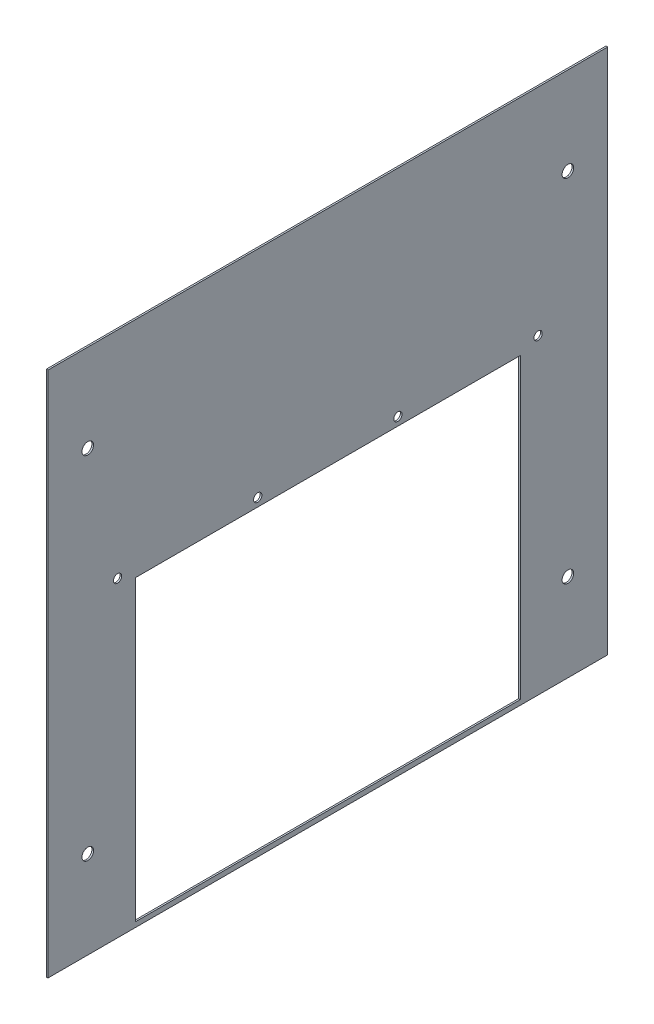
ISO-10303-21;
HEADER;
FILE_DESCRIPTION(('STEP AP214'),'2;1');
FILE_NAME('part.step','',(''),(''),'','','');
FILE_SCHEMA(('AUTOMOTIVE_DESIGN { 1 0 10303 214 1 1 1 1 }'));
ENDSEC;
DATA;
#1=APPLICATION_CONTEXT('core data for automotive mechanical design processes');
#2=APPLICATION_PROTOCOL_DEFINITION('international standard','automotive_design',2000,#1);
#3=PRODUCT_CONTEXT('',#1,'mechanical');
#4=PRODUCT('Part','Part','',(#3));
#5=PRODUCT_RELATED_PRODUCT_CATEGORY('part','',(#4));
#6=PRODUCT_DEFINITION_FORMATION('','',#4);
#7=PRODUCT_DEFINITION_CONTEXT('part definition',#1,'design');
#8=PRODUCT_DEFINITION('design','',#6,#7);
#9=PRODUCT_DEFINITION_SHAPE('','',#8);
#10=(LENGTH_UNIT() NAMED_UNIT(*) SI_UNIT(.MILLI.,.METRE.));
#11=(NAMED_UNIT(*) PLANE_ANGLE_UNIT() SI_UNIT($,.RADIAN.));
#12=(NAMED_UNIT(*) SI_UNIT($,.STERADIAN.) SOLID_ANGLE_UNIT());
#13=UNCERTAINTY_MEASURE_WITH_UNIT(LENGTH_MEASURE(1.E-05),#10,'distance_accuracy_value','');
#14=(GEOMETRIC_REPRESENTATION_CONTEXT(3) GLOBAL_UNCERTAINTY_ASSIGNED_CONTEXT((#13)) GLOBAL_UNIT_ASSIGNED_CONTEXT((#10,
#11,#12)) REPRESENTATION_CONTEXT('',''));
#15=CARTESIAN_POINT('',(0.,0.,0.));
#16=DIRECTION('',(0.,0.,1.));
#17=DIRECTION('',(1.,0.,0.));
#18=AXIS2_PLACEMENT_3D('',#15,#16,#17);
#19=CARTESIAN_POINT('',(1.,0.,0.));
#20=DIRECTION('',(-1.,0.,0.));
#21=DIRECTION('',(0.,0.,1.));
#22=AXIS2_PLACEMENT_3D('',#19,#20,#21);
#23=PLANE('',#22);
#24=CARTESIAN_POINT('',(1.,188.,-296.));
#25=DIRECTION('',(-1.,0.,0.));
#26=DIRECTION('',(0.,0.,1.));
#27=AXIS2_PLACEMENT_3D('',#24,#25,#26);
#28=CIRCLE('',#27,2.50000000000002);
#29=CARTESIAN_POINT('',(1.,188.,-293.5));
#30=VERTEX_POINT('',#29);
#31=EDGE_CURVE('E183',#30,#30,#28,.T.);
#32=ORIENTED_EDGE('',*,*,#31,.T.);
#33=EDGE_LOOP('',(#32));
#34=FACE_BOUND('',#33,.T.);
#35=DIRECTION('',(0.,0.,-1.));
#36=VECTOR('',#35,1.);
#37=CARTESIAN_POINT('',(1.,183.,-285.25));
#38=LINE('',#37,#36);
#39=CARTESIAN_POINT('',(1.,183.,-52.75));
#40=VERTEX_POINT('',#39);
#41=CARTESIAN_POINT('',(1.,183.,-285.25));
#42=VERTEX_POINT('',#41);
#43=EDGE_CURVE('E145',#40,#42,#38,.T.);
#44=ORIENTED_EDGE('',*,*,#43,.T.);
#45=DIRECTION('',(0.,-1.,0.));
#46=VECTOR('',#45,1.);
#47=CARTESIAN_POINT('',(1.,183.,-285.25));
#48=LINE('',#47,#46);
#49=CARTESIAN_POINT('',(1.,3.,-285.25));
#50=VERTEX_POINT('',#49);
#51=EDGE_CURVE('E113',#42,#50,#48,.T.);
#52=ORIENTED_EDGE('',*,*,#51,.T.);
#53=DIRECTION('',(0.,0.,1.));
#54=VECTOR('',#53,1.);
#55=CARTESIAN_POINT('',(1.,3.,-285.25));
#56=LINE('',#55,#54);
#57=CARTESIAN_POINT('',(1.,3.,-52.75));
#58=VERTEX_POINT('',#57);
#59=EDGE_CURVE('E151',#50,#58,#56,.T.);
#60=ORIENTED_EDGE('',*,*,#59,.T.);
#61=DIRECTION('',(0.,1.,0.));
#62=VECTOR('',#61,1.);
#63=CARTESIAN_POINT('',(1.,183.,-52.75));
#64=LINE('',#63,#62);
#65=EDGE_CURVE('E61',#58,#40,#64,.T.);
#66=ORIENTED_EDGE('',*,*,#65,.T.);
#67=EDGE_LOOP('',(#44,#52,#60,#66));
#68=FACE_BOUND('',#67,.T.);
#69=CARTESIAN_POINT('',(1.,188.,-42.));
#70=DIRECTION('',(-1.,0.,0.));
#71=DIRECTION('',(0.,0.,1.));
#72=AXIS2_PLACEMENT_3D('',#69,#70,#71);
#73=CIRCLE('',#72,2.5);
#74=CARTESIAN_POINT('',(1.,188.,-39.5));
#75=VERTEX_POINT('',#74);
#76=EDGE_CURVE('E135',#75,#75,#73,.T.);
#77=ORIENTED_EDGE('',*,*,#76,.T.);
#78=EDGE_LOOP('',(#77));
#79=FACE_BOUND('',#78,.T.);
#80=CARTESIAN_POINT('',(1.,188.,-126.666666666667));
#81=DIRECTION('',(-1.,0.,0.));
#82=DIRECTION('',(0.,0.,1.));
#83=AXIS2_PLACEMENT_3D('',#80,#81,#82);
#84=CIRCLE('',#83,2.5);
#85=CARTESIAN_POINT('',(1.,188.,-124.166666666667));
#86=VERTEX_POINT('',#85);
#87=EDGE_CURVE('E170',#86,#86,#84,.T.);
#88=ORIENTED_EDGE('',*,*,#87,.T.);
#89=EDGE_LOOP('',(#88));
#90=FACE_BOUND('',#89,.T.);
#91=CARTESIAN_POINT('',(1.,188.,-211.333333333333));
#92=DIRECTION('',(-1.,0.,0.));
#93=DIRECTION('',(0.,0.,1.));
#94=AXIS2_PLACEMENT_3D('',#91,#92,#93);
#95=CIRCLE('',#94,2.5);
#96=CARTESIAN_POINT('',(1.,188.,-208.833333333333));
#97=VERTEX_POINT('',#96);
#98=EDGE_CURVE('E162',#97,#97,#95,.T.);
#99=ORIENTED_EDGE('',*,*,#98,.T.);
#100=EDGE_LOOP('',(#99));
#101=FACE_BOUND('',#100,.T.);
#102=DIRECTION('',(0.,-1.,0.));
#103=VECTOR('',#102,1.);
#104=CARTESIAN_POINT('',(1.,0.,0.));
#105=LINE('',#104,#103);
#106=CARTESIAN_POINT('',(1.,318.,0.));
#107=VERTEX_POINT('',#106);
#108=CARTESIAN_POINT('',(1.,0.,0.));
#109=VERTEX_POINT('',#108);
#110=EDGE_CURVE('E208',#107,#109,#105,.T.);
#111=ORIENTED_EDGE('',*,*,#110,.T.);
#112=DIRECTION('',(0.,0.,-1.));
#113=VECTOR('',#112,1.);
#114=CARTESIAN_POINT('',(1.,0.,0.));
#115=LINE('',#114,#113);
#116=CARTESIAN_POINT('',(1.,0.,-338.));
#117=VERTEX_POINT('',#116);
#118=EDGE_CURVE('E212',#109,#117,#115,.T.);
#119=ORIENTED_EDGE('',*,*,#118,.T.);
#120=DIRECTION('',(0.,1.,0.));
#121=VECTOR('',#120,1.);
#122=CARTESIAN_POINT('',(1.,0.,-338.));
#123=LINE('',#122,#121);
#124=CARTESIAN_POINT('',(1.,318.,-338.));
#125=VERTEX_POINT('',#124);
#126=EDGE_CURVE('E216',#117,#125,#123,.T.);
#127=ORIENTED_EDGE('',*,*,#126,.T.);
#128=DIRECTION('',(0.,0.,1.));
#129=VECTOR('',#128,1.);
#130=CARTESIAN_POINT('',(1.,318.,0.));
#131=LINE('',#130,#129);
#132=EDGE_CURVE('E219',#125,#107,#131,.T.);
#133=ORIENTED_EDGE('',*,*,#132,.T.);
#134=EDGE_LOOP('',(#111,#119,#127,#133));
#135=FACE_BOUND('',#134,.T.);
#136=CARTESIAN_POINT('',(1.,265.06,-24.));
#137=DIRECTION('',(1.,0.,0.));
#138=DIRECTION('',(0.,0.,-1.));
#139=AXIS2_PLACEMENT_3D('',#136,#137,#138);
#140=CIRCLE('',#139,3.5);
#141=CARTESIAN_POINT('',(1.,265.06,-27.5));
#142=VERTEX_POINT('',#141);
#143=EDGE_CURVE('E200',#142,#142,#140,.T.);
#144=ORIENTED_EDGE('',*,*,#143,.F.);
#145=EDGE_LOOP('',(#144));
#146=FACE_BOUND('',#145,.T.);
#147=CARTESIAN_POINT('',(1.,265.06,-314.));
#148=DIRECTION('',(1.,0.,0.));
#149=DIRECTION('',(0.,0.,-1.));
#150=AXIS2_PLACEMENT_3D('',#147,#148,#149);
#151=CIRCLE('',#150,3.50000000000002);
#152=CARTESIAN_POINT('',(1.,265.06,-317.5));
#153=VERTEX_POINT('',#152);
#154=EDGE_CURVE('E192',#153,#153,#151,.T.);
#155=ORIENTED_EDGE('',*,*,#154,.F.);
#156=EDGE_LOOP('',(#155));
#157=FACE_BOUND('',#156,.T.);
#158=CARTESIAN_POINT('',(1.,52.94,-314.));
#159=DIRECTION('',(1.,0.,0.));
#160=DIRECTION('',(0.,0.,-1.));
#161=AXIS2_PLACEMENT_3D('',#158,#159,#160);
#162=CIRCLE('',#161,3.50000000000002);
#163=CARTESIAN_POINT('',(1.,52.94,-317.5));
#164=VERTEX_POINT('',#163);
#165=EDGE_CURVE('E184',#164,#164,#162,.T.);
#166=ORIENTED_EDGE('',*,*,#165,.F.);
#167=EDGE_LOOP('',(#166));
#168=FACE_BOUND('',#167,.T.);
#169=CARTESIAN_POINT('',(1.,52.94,-24.));
#170=DIRECTION('',(1.,0.,0.));
#171=DIRECTION('',(0.,0.,-1.));
#172=AXIS2_PLACEMENT_3D('',#169,#170,#171);
#173=CIRCLE('',#172,3.5);
#174=CARTESIAN_POINT('',(1.,52.94,-27.5));
#175=VERTEX_POINT('',#174);
#176=EDGE_CURVE('E174',#175,#175,#173,.T.);
#177=ORIENTED_EDGE('',*,*,#176,.F.);
#178=EDGE_LOOP('',(#177));
#179=FACE_BOUND('',#178,.T.);
#180=ADVANCED_FACE('F45',(#34,#68,#79,#90,#101,#135,#146,#157,#168,#179),#23,.F.);
#181=CARTESIAN_POINT('',(0.,0.,0.));
#182=DIRECTION('',(-1.,0.,0.));
#183=DIRECTION('',(0.,0.,1.));
#184=AXIS2_PLACEMENT_3D('',#181,#182,#183);
#185=PLANE('',#184);
#186=CARTESIAN_POINT('',(0.,188.,-296.));
#187=DIRECTION('',(-1.,0.,0.));
#188=DIRECTION('',(0.,0.,1.));
#189=AXIS2_PLACEMENT_3D('',#186,#187,#188);
#190=CIRCLE('',#189,2.50000000000002);
#191=CARTESIAN_POINT('',(0.,188.,-293.5));
#192=VERTEX_POINT('',#191);
#193=EDGE_CURVE('E161',#192,#192,#190,.T.);
#194=ORIENTED_EDGE('',*,*,#193,.F.);
#195=EDGE_LOOP('',(#194));
#196=FACE_BOUND('',#195,.T.);
#197=DIRECTION('',(0.,-1.,0.));
#198=VECTOR('',#197,1.);
#199=CARTESIAN_POINT('',(0.,183.,-285.25));
#200=LINE('',#199,#198);
#201=CARTESIAN_POINT('',(0.,183.,-285.25));
#202=VERTEX_POINT('',#201);
#203=CARTESIAN_POINT('',(0.,3.,-285.25));
#204=VERTEX_POINT('',#203);
#205=EDGE_CURVE('E69',#202,#204,#200,.T.);
#206=ORIENTED_EDGE('',*,*,#205,.F.);
#207=DIRECTION('',(0.,0.,-1.));
#208=VECTOR('',#207,1.);
#209=CARTESIAN_POINT('',(0.,183.,-285.25));
#210=LINE('',#209,#208);
#211=CARTESIAN_POINT('',(0.,183.,-52.75));
#212=VERTEX_POINT('',#211);
#213=EDGE_CURVE('E121',#212,#202,#210,.T.);
#214=ORIENTED_EDGE('',*,*,#213,.F.);
#215=DIRECTION('',(0.,1.,0.));
#216=VECTOR('',#215,1.);
#217=CARTESIAN_POINT('',(0.,183.,-52.75));
#218=LINE('',#217,#216);
#219=CARTESIAN_POINT('',(0.,3.,-52.75));
#220=VERTEX_POINT('',#219);
#221=EDGE_CURVE('E127',#220,#212,#218,.T.);
#222=ORIENTED_EDGE('',*,*,#221,.F.);
#223=DIRECTION('',(0.,0.,1.));
#224=VECTOR('',#223,1.);
#225=CARTESIAN_POINT('',(0.,3.,-285.25));
#226=LINE('',#225,#224);
#227=EDGE_CURVE('E133',#204,#220,#226,.T.);
#228=ORIENTED_EDGE('',*,*,#227,.F.);
#229=EDGE_LOOP('',(#206,#214,#222,#228));
#230=FACE_BOUND('',#229,.T.);
#231=CARTESIAN_POINT('',(0.,188.,-42.));
#232=DIRECTION('',(-1.,0.,0.));
#233=DIRECTION('',(0.,0.,1.));
#234=AXIS2_PLACEMENT_3D('',#231,#232,#233);
#235=CIRCLE('',#234,2.5);
#236=CARTESIAN_POINT('',(0.,188.,-39.5));
#237=VERTEX_POINT('',#236);
#238=EDGE_CURVE('E140',#237,#237,#235,.T.);
#239=ORIENTED_EDGE('',*,*,#238,.F.);
#240=EDGE_LOOP('',(#239));
#241=FACE_BOUND('',#240,.T.);
#242=CARTESIAN_POINT('',(0.,188.,-126.666666666667));
#243=DIRECTION('',(-1.,0.,0.));
#244=DIRECTION('',(0.,0.,1.));
#245=AXIS2_PLACEMENT_3D('',#242,#243,#244);
#246=CIRCLE('',#245,2.5);
#247=CARTESIAN_POINT('',(0.,188.,-124.166666666667));
#248=VERTEX_POINT('',#247);
#249=EDGE_CURVE('E166',#248,#248,#246,.T.);
#250=ORIENTED_EDGE('',*,*,#249,.F.);
#251=EDGE_LOOP('',(#250));
#252=FACE_BOUND('',#251,.T.);
#253=CARTESIAN_POINT('',(0.,188.,-211.333333333333));
#254=DIRECTION('',(-1.,0.,0.));
#255=DIRECTION('',(0.,0.,1.));
#256=AXIS2_PLACEMENT_3D('',#253,#254,#255);
#257=CIRCLE('',#256,2.5);
#258=CARTESIAN_POINT('',(0.,188.,-208.833333333333));
#259=VERTEX_POINT('',#258);
#260=EDGE_CURVE('E157',#259,#259,#257,.T.);
#261=ORIENTED_EDGE('',*,*,#260,.F.);
#262=EDGE_LOOP('',(#261));
#263=FACE_BOUND('',#262,.T.);
#264=CARTESIAN_POINT('',(0.,52.94,-314.));
#265=DIRECTION('',(1.,0.,0.));
#266=DIRECTION('',(0.,0.,-1.));
#267=AXIS2_PLACEMENT_3D('',#264,#265,#266);
#268=CIRCLE('',#267,3.50000000000002);
#269=CARTESIAN_POINT('',(0.,52.94,-317.5));
#270=VERTEX_POINT('',#269);
#271=EDGE_CURVE('E178',#270,#270,#268,.T.);
#272=ORIENTED_EDGE('',*,*,#271,.T.);
#273=EDGE_LOOP('',(#272));
#274=FACE_BOUND('',#273,.T.);
#275=CARTESIAN_POINT('',(0.,265.06,-24.));
#276=DIRECTION('',(1.,0.,0.));
#277=DIRECTION('',(0.,0.,-1.));
#278=AXIS2_PLACEMENT_3D('',#275,#276,#277);
#279=CIRCLE('',#278,3.5);
#280=CARTESIAN_POINT('',(0.,265.06,-27.5));
#281=VERTEX_POINT('',#280);
#282=EDGE_CURVE('E196',#281,#281,#279,.T.);
#283=ORIENTED_EDGE('',*,*,#282,.T.);
#284=EDGE_LOOP('',(#283));
#285=FACE_BOUND('',#284,.T.);
#286=DIRECTION('',(0.,-1.,0.));
#287=VECTOR('',#286,1.);
#288=CARTESIAN_POINT('',(0.,0.,0.));
#289=LINE('',#288,#287);
#290=CARTESIAN_POINT('',(0.,318.,0.));
#291=VERTEX_POINT('',#290);
#292=CARTESIAN_POINT('',(0.,0.,0.));
#293=VERTEX_POINT('',#292);
#294=EDGE_CURVE('E204',#291,#293,#289,.T.);
#295=ORIENTED_EDGE('',*,*,#294,.F.);
#296=DIRECTION('',(0.,0.,1.));
#297=VECTOR('',#296,1.);
#298=CARTESIAN_POINT('',(0.,318.,0.));
#299=LINE('',#298,#297);
#300=CARTESIAN_POINT('',(0.,318.,-338.));
#301=VERTEX_POINT('',#300);
#302=EDGE_CURVE('E213',#301,#291,#299,.T.);
#303=ORIENTED_EDGE('',*,*,#302,.F.);
#304=DIRECTION('',(0.,1.,0.));
#305=VECTOR('',#304,1.);
#306=CARTESIAN_POINT('',(0.,0.,-338.));
#307=LINE('',#306,#305);
#308=CARTESIAN_POINT('',(0.,0.,-338.));
#309=VERTEX_POINT('',#308);
#310=EDGE_CURVE('E229',#309,#301,#307,.T.);
#311=ORIENTED_EDGE('',*,*,#310,.F.);
#312=DIRECTION('',(0.,0.,-1.));
#313=VECTOR('',#312,1.);
#314=CARTESIAN_POINT('',(0.,0.,0.));
#315=LINE('',#314,#313);
#316=EDGE_CURVE('E226',#293,#309,#315,.T.);
#317=ORIENTED_EDGE('',*,*,#316,.F.);
#318=EDGE_LOOP('',(#295,#303,#311,#317));
#319=FACE_BOUND('',#318,.T.);
#320=CARTESIAN_POINT('',(0.,265.06,-314.));
#321=DIRECTION('',(1.,0.,0.));
#322=DIRECTION('',(0.,0.,-1.));
#323=AXIS2_PLACEMENT_3D('',#320,#321,#322);
#324=CIRCLE('',#323,3.50000000000002);
#325=CARTESIAN_POINT('',(0.,265.06,-317.5));
#326=VERTEX_POINT('',#325);
#327=EDGE_CURVE('E188',#326,#326,#324,.T.);
#328=ORIENTED_EDGE('',*,*,#327,.T.);
#329=EDGE_LOOP('',(#328));
#330=FACE_BOUND('',#329,.T.);
#331=CARTESIAN_POINT('',(0.,52.94,-24.));
#332=DIRECTION('',(1.,0.,0.));
#333=DIRECTION('',(0.,0.,-1.));
#334=AXIS2_PLACEMENT_3D('',#331,#332,#333);
#335=CIRCLE('',#334,3.5);
#336=CARTESIAN_POINT('',(0.,52.94,-27.5));
#337=VERTEX_POINT('',#336);
#338=EDGE_CURVE('E179',#337,#337,#335,.T.);
#339=ORIENTED_EDGE('',*,*,#338,.T.);
#340=EDGE_LOOP('',(#339));
#341=FACE_BOUND('',#340,.T.);
#342=ADVANCED_FACE('F130',(#196,#230,#241,#252,#263,#274,#285,#319,#330,#341),#185,.T.);
#343=CARTESIAN_POINT('',(1.,0.,0.));
#344=DIRECTION('',(0.,0.,-1.));
#345=DIRECTION('',(-1.,0.,0.));
#346=AXIS2_PLACEMENT_3D('',#343,#344,#345);
#347=PLANE('',#346);
#348=ORIENTED_EDGE('',*,*,#294,.T.);
#349=DIRECTION('',(-1.,0.,0.));
#350=VECTOR('',#349,1.);
#351=CARTESIAN_POINT('',(1.,0.,0.));
#352=LINE('',#351,#350);
#353=EDGE_CURVE('E11',#109,#293,#352,.T.);
#354=ORIENTED_EDGE('',*,*,#353,.F.);
#355=ORIENTED_EDGE('',*,*,#110,.F.);
#356=DIRECTION('',(-1.,0.,0.));
#357=VECTOR('',#356,1.);
#358=CARTESIAN_POINT('',(1.,318.,0.));
#359=LINE('',#358,#357);
#360=EDGE_CURVE('E222',#107,#291,#359,.T.);
#361=ORIENTED_EDGE('',*,*,#360,.T.);
#362=EDGE_LOOP('',(#348,#354,#355,#361));
#363=FACE_BOUND('',#362,.T.);
#364=ADVANCED_FACE('F47',(#363),#347,.F.);
#365=CARTESIAN_POINT('',(1.,0.,0.));
#366=DIRECTION('',(0.,1.,0.));
#367=DIRECTION('',(0.,0.,1.));
#368=AXIS2_PLACEMENT_3D('',#365,#366,#367);
#369=PLANE('',#368);
#370=ORIENTED_EDGE('',*,*,#316,.T.);
#371=DIRECTION('',(-1.,0.,0.));
#372=VECTOR('',#371,1.);
#373=CARTESIAN_POINT('',(1.,0.,-338.));
#374=LINE('',#373,#372);
#375=EDGE_CURVE('E54',#117,#309,#374,.T.);
#376=ORIENTED_EDGE('',*,*,#375,.F.);
#377=ORIENTED_EDGE('',*,*,#118,.F.);
#378=ORIENTED_EDGE('',*,*,#353,.T.);
#379=EDGE_LOOP('',(#370,#376,#377,#378));
#380=FACE_BOUND('',#379,.T.);
#381=ADVANCED_FACE('F262',(#380),#369,.F.);
#382=CARTESIAN_POINT('',(1.,0.,-338.));
#383=DIRECTION('',(0.,0.,1.));
#384=DIRECTION('',(1.,0.,0.));
#385=AXIS2_PLACEMENT_3D('',#382,#383,#384);
#386=PLANE('',#385);
#387=ORIENTED_EDGE('',*,*,#310,.T.);
#388=DIRECTION('',(-1.,0.,0.));
#389=VECTOR('',#388,1.);
#390=CARTESIAN_POINT('',(1.,318.,-338.));
#391=LINE('',#390,#389);
#392=EDGE_CURVE('E237',#125,#301,#391,.T.);
#393=ORIENTED_EDGE('',*,*,#392,.F.);
#394=ORIENTED_EDGE('',*,*,#126,.F.);
#395=ORIENTED_EDGE('',*,*,#375,.T.);
#396=EDGE_LOOP('',(#387,#393,#394,#395));
#397=FACE_BOUND('',#396,.T.);
#398=ADVANCED_FACE('F246',(#397),#386,.F.);
#399=CARTESIAN_POINT('',(1.,318.,0.));
#400=DIRECTION('',(0.,-1.,0.));
#401=DIRECTION('',(0.,0.,-1.));
#402=AXIS2_PLACEMENT_3D('',#399,#400,#401);
#403=PLANE('',#402);
#404=ORIENTED_EDGE('',*,*,#302,.T.);
#405=ORIENTED_EDGE('',*,*,#360,.F.);
#406=ORIENTED_EDGE('',*,*,#132,.F.);
#407=ORIENTED_EDGE('',*,*,#392,.T.);
#408=EDGE_LOOP('',(#404,#405,#406,#407));
#409=FACE_BOUND('',#408,.T.);
#410=ADVANCED_FACE('F255',(#409),#403,.F.);
#411=CARTESIAN_POINT('',(1.,265.06,-24.));
#412=DIRECTION('',(-1.,0.,0.));
#413=DIRECTION('',(0.,0.,1.));
#414=AXIS2_PLACEMENT_3D('',#411,#412,#413);
#415=CYLINDRICAL_SURFACE('',#414,3.5);
#416=ORIENTED_EDGE('',*,*,#143,.T.);
#417=EDGE_LOOP('',(#416));
#418=FACE_BOUND('',#417,.T.);
#419=ORIENTED_EDGE('',*,*,#282,.F.);
#420=EDGE_LOOP('',(#419));
#421=FACE_BOUND('',#420,.T.);
#422=ADVANCED_FACE('F281',(#418,#421),#415,.F.);
#423=CARTESIAN_POINT('',(1.,265.06,-314.));
#424=DIRECTION('',(-1.,0.,0.));
#425=DIRECTION('',(0.,0.,1.));
#426=AXIS2_PLACEMENT_3D('',#423,#424,#425);
#427=CYLINDRICAL_SURFACE('',#426,3.50000000000002);
#428=ORIENTED_EDGE('',*,*,#154,.T.);
#429=EDGE_LOOP('',(#428));
#430=FACE_BOUND('',#429,.T.);
#431=ORIENTED_EDGE('',*,*,#327,.F.);
#432=EDGE_LOOP('',(#431));
#433=FACE_BOUND('',#432,.T.);
#434=ADVANCED_FACE('F288',(#430,#433),#427,.F.);
#435=CARTESIAN_POINT('',(1.,52.94,-314.));
#436=DIRECTION('',(-1.,0.,0.));
#437=DIRECTION('',(0.,0.,1.));
#438=AXIS2_PLACEMENT_3D('',#435,#436,#437);
#439=CYLINDRICAL_SURFACE('',#438,3.50000000000002);
#440=ORIENTED_EDGE('',*,*,#165,.T.);
#441=EDGE_LOOP('',(#440));
#442=FACE_BOUND('',#441,.T.);
#443=ORIENTED_EDGE('',*,*,#271,.F.);
#444=EDGE_LOOP('',(#443));
#445=FACE_BOUND('',#444,.T.);
#446=ADVANCED_FACE('F293',(#442,#445),#439,.F.);
#447=CARTESIAN_POINT('',(1.,52.94,-24.));
#448=DIRECTION('',(-1.,0.,0.));
#449=DIRECTION('',(0.,0.,1.));
#450=AXIS2_PLACEMENT_3D('',#447,#448,#449);
#451=CYLINDRICAL_SURFACE('',#450,3.5);
#452=ORIENTED_EDGE('',*,*,#176,.T.);
#453=EDGE_LOOP('',(#452));
#454=FACE_BOUND('',#453,.T.);
#455=ORIENTED_EDGE('',*,*,#338,.F.);
#456=EDGE_LOOP('',(#455));
#457=FACE_BOUND('',#456,.T.);
#458=ADVANCED_FACE('F306',(#454,#457),#451,.F.);
#459=CARTESIAN_POINT('',(1.,188.,-211.333333333333));
#460=DIRECTION('',(-1.,0.,0.));
#461=DIRECTION('',(0.,0.,1.));
#462=AXIS2_PLACEMENT_3D('',#459,#460,#461);
#463=CYLINDRICAL_SURFACE('',#462,2.5);
#464=ORIENTED_EDGE('',*,*,#98,.F.);
#465=EDGE_LOOP('',(#464));
#466=FACE_BOUND('',#465,.T.);
#467=ORIENTED_EDGE('',*,*,#260,.T.);
#468=EDGE_LOOP('',(#467));
#469=FACE_BOUND('',#468,.T.);
#470=ADVANCED_FACE('F308',(#466,#469),#463,.F.);
#471=CARTESIAN_POINT('',(1.,188.,-126.666666666667));
#472=DIRECTION('',(-1.,0.,0.));
#473=DIRECTION('',(0.,0.,1.));
#474=AXIS2_PLACEMENT_3D('',#471,#472,#473);
#475=CYLINDRICAL_SURFACE('',#474,2.5);
#476=ORIENTED_EDGE('',*,*,#87,.F.);
#477=EDGE_LOOP('',(#476));
#478=FACE_BOUND('',#477,.T.);
#479=ORIENTED_EDGE('',*,*,#249,.T.);
#480=EDGE_LOOP('',(#479));
#481=FACE_BOUND('',#480,.T.);
#482=ADVANCED_FACE('F316',(#478,#481),#475,.F.);
#483=CARTESIAN_POINT('',(1.,188.,-42.));
#484=DIRECTION('',(-1.,0.,0.));
#485=DIRECTION('',(0.,0.,1.));
#486=AXIS2_PLACEMENT_3D('',#483,#484,#485);
#487=CYLINDRICAL_SURFACE('',#486,2.5);
#488=ORIENTED_EDGE('',*,*,#76,.F.);
#489=EDGE_LOOP('',(#488));
#490=FACE_BOUND('',#489,.T.);
#491=ORIENTED_EDGE('',*,*,#238,.T.);
#492=EDGE_LOOP('',(#491));
#493=FACE_BOUND('',#492,.T.);
#494=ADVANCED_FACE('F323',(#490,#493),#487,.F.);
#495=CARTESIAN_POINT('',(1.,183.,-285.25));
#496=DIRECTION('',(0.,0.,-1.));
#497=DIRECTION('',(-1.,0.,0.));
#498=AXIS2_PLACEMENT_3D('',#495,#496,#497);
#499=PLANE('',#498);
#500=ORIENTED_EDGE('',*,*,#205,.T.);
#501=DIRECTION('',(-1.,0.,0.));
#502=VECTOR('',#501,1.);
#503=CARTESIAN_POINT('',(1.,3.,-285.25));
#504=LINE('',#503,#502);
#505=EDGE_CURVE('E148',#50,#204,#504,.T.);
#506=ORIENTED_EDGE('',*,*,#505,.F.);
#507=ORIENTED_EDGE('',*,*,#51,.F.);
#508=DIRECTION('',(-1.,0.,0.));
#509=VECTOR('',#508,1.);
#510=CARTESIAN_POINT('',(1.,183.,-285.25));
#511=LINE('',#510,#509);
#512=EDGE_CURVE('E109',#42,#202,#511,.T.);
#513=ORIENTED_EDGE('',*,*,#512,.T.);
#514=EDGE_LOOP('',(#500,#506,#507,#513));
#515=FACE_BOUND('',#514,.T.);
#516=ADVANCED_FACE('F111',(#515),#499,.F.);
#517=CARTESIAN_POINT('',(1.,183.,-285.25));
#518=DIRECTION('',(0.,1.,0.));
#519=DIRECTION('',(0.,0.,1.));
#520=AXIS2_PLACEMENT_3D('',#517,#518,#519);
#521=PLANE('',#520);
#522=ORIENTED_EDGE('',*,*,#213,.T.);
#523=ORIENTED_EDGE('',*,*,#512,.F.);
#524=ORIENTED_EDGE('',*,*,#43,.F.);
#525=DIRECTION('',(-1.,0.,0.));
#526=VECTOR('',#525,1.);
#527=CARTESIAN_POINT('',(1.,183.,-52.75));
#528=LINE('',#527,#526);
#529=EDGE_CURVE('E118',#40,#212,#528,.T.);
#530=ORIENTED_EDGE('',*,*,#529,.T.);
#531=EDGE_LOOP('',(#522,#523,#524,#530));
#532=FACE_BOUND('',#531,.T.);
#533=ADVANCED_FACE('F122',(#532),#521,.F.);
#534=CARTESIAN_POINT('',(1.,183.,-52.75));
#535=DIRECTION('',(0.,0.,1.));
#536=DIRECTION('',(1.,0.,0.));
#537=AXIS2_PLACEMENT_3D('',#534,#535,#536);
#538=PLANE('',#537);
#539=ORIENTED_EDGE('',*,*,#221,.T.);
#540=ORIENTED_EDGE('',*,*,#529,.F.);
#541=ORIENTED_EDGE('',*,*,#65,.F.);
#542=DIRECTION('',(-1.,0.,0.));
#543=VECTOR('',#542,1.);
#544=CARTESIAN_POINT('',(1.,3.,-52.75));
#545=LINE('',#544,#543);
#546=EDGE_CURVE('E359',#58,#220,#545,.T.);
#547=ORIENTED_EDGE('',*,*,#546,.T.);
#548=EDGE_LOOP('',(#539,#540,#541,#547));
#549=FACE_BOUND('',#548,.T.);
#550=ADVANCED_FACE('F328',(#549),#538,.F.);
#551=CARTESIAN_POINT('',(1.,3.,-285.25));
#552=DIRECTION('',(0.,-1.,0.));
#553=DIRECTION('',(0.,0.,-1.));
#554=AXIS2_PLACEMENT_3D('',#551,#552,#553);
#555=PLANE('',#554);
#556=ORIENTED_EDGE('',*,*,#227,.T.);
#557=ORIENTED_EDGE('',*,*,#546,.F.);
#558=ORIENTED_EDGE('',*,*,#59,.F.);
#559=ORIENTED_EDGE('',*,*,#505,.T.);
#560=EDGE_LOOP('',(#556,#557,#558,#559));
#561=FACE_BOUND('',#560,.T.);
#562=ADVANCED_FACE('F331',(#561),#555,.F.);
#563=CARTESIAN_POINT('',(1.,188.,-296.));
#564=DIRECTION('',(-1.,0.,0.));
#565=DIRECTION('',(0.,0.,1.));
#566=AXIS2_PLACEMENT_3D('',#563,#564,#565);
#567=CYLINDRICAL_SURFACE('',#566,2.50000000000002);
#568=ORIENTED_EDGE('',*,*,#31,.F.);
#569=EDGE_LOOP('',(#568));
#570=FACE_BOUND('',#569,.T.);
#571=ORIENTED_EDGE('',*,*,#193,.T.);
#572=EDGE_LOOP('',(#571));
#573=FACE_BOUND('',#572,.T.);
#574=ADVANCED_FACE('F334',(#570,#573),#567,.F.);
#575=CLOSED_SHELL('',(#180,#342,#364,#381,#398,#410,#422,#434,#446,#458,#470,#482,#494,#516,
#533,#550,#562,#574));
#576=MANIFOLD_SOLID_BREP('B2',#575);
#577=ADVANCED_BREP_SHAPE_REPRESENTATION('',(#18,#576),#14);
#578=SHAPE_DEFINITION_REPRESENTATION(#9,#577);
ENDSEC;
END-ISO-10303-21;
